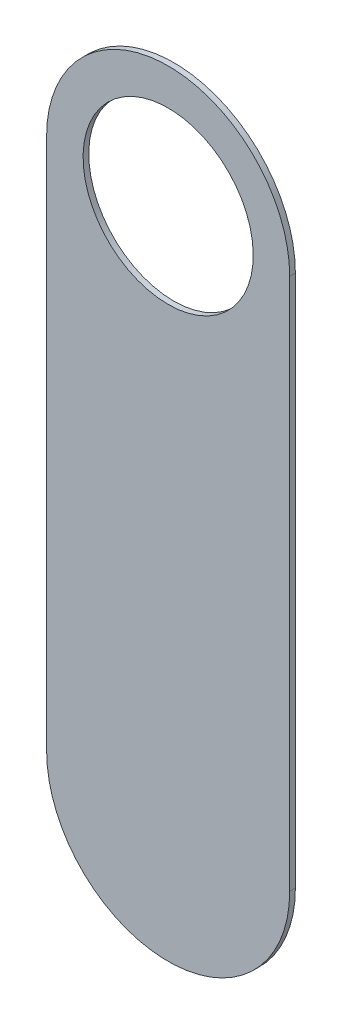
ISO-10303-21;
HEADER;
FILE_DESCRIPTION(('STEP AP214'),'2;1');
FILE_NAME('part.step','',(''),(''),'','','');
FILE_SCHEMA(('AUTOMOTIVE_DESIGN { 1 0 10303 214 1 1 1 1 }'));
ENDSEC;
DATA;
#1=APPLICATION_CONTEXT('core data for automotive mechanical design processes');
#2=APPLICATION_PROTOCOL_DEFINITION('international standard','automotive_design',2000,#1);
#3=PRODUCT_CONTEXT('',#1,'mechanical');
#4=PRODUCT('Part','Part','',(#3));
#5=PRODUCT_RELATED_PRODUCT_CATEGORY('part','',(#4));
#6=PRODUCT_DEFINITION_FORMATION('','',#4);
#7=PRODUCT_DEFINITION_CONTEXT('part definition',#1,'design');
#8=PRODUCT_DEFINITION('design','',#6,#7);
#9=PRODUCT_DEFINITION_SHAPE('','',#8);
#10=(LENGTH_UNIT() NAMED_UNIT(*) SI_UNIT(.MILLI.,.METRE.));
#11=(NAMED_UNIT(*) PLANE_ANGLE_UNIT() SI_UNIT($,.RADIAN.));
#12=(NAMED_UNIT(*) SI_UNIT($,.STERADIAN.) SOLID_ANGLE_UNIT());
#13=UNCERTAINTY_MEASURE_WITH_UNIT(LENGTH_MEASURE(1.E-05),#10,'distance_accuracy_value','');
#14=(GEOMETRIC_REPRESENTATION_CONTEXT(3) GLOBAL_UNCERTAINTY_ASSIGNED_CONTEXT((#13)) GLOBAL_UNIT_ASSIGNED_CONTEXT((#10,
#11,#12)) REPRESENTATION_CONTEXT('',''));
#15=CARTESIAN_POINT('',(0.,0.,0.));
#16=DIRECTION('',(0.,0.,1.));
#17=DIRECTION('',(1.,0.,0.));
#18=AXIS2_PLACEMENT_3D('',#15,#16,#17);
#19=CARTESIAN_POINT('',(154.002,-113.984,-0.045));
#20=DIRECTION('',(0.,0.,-1.));
#21=DIRECTION('',(0.,-1.,0.));
#22=AXIS2_PLACEMENT_3D('',#19,#20,#21);
#23=CYLINDRICAL_SURFACE('',#22,0.525);
#24=CARTESIAN_POINT('',(154.002,-113.984,-0.035));
#25=DIRECTION('',(0.,0.,-1.));
#26=DIRECTION('',(0.,-1.,0.));
#27=AXIS2_PLACEMENT_3D('',#24,#25,#26);
#28=CIRCLE('',#27,0.525);
#29=CARTESIAN_POINT('',(154.002,-114.509,-0.035));
#30=VERTEX_POINT('',#29);
#31=EDGE_CURVE('E116',#30,#30,#28,.T.);
#32=ORIENTED_EDGE('',*,*,#31,.T.);
#33=DIRECTION('',(0.,0.,1.));
#34=VECTOR('',#33,1.);
#35=CARTESIAN_POINT('',(154.002,-114.509,-0.045));
#36=LINE('',#35,#34);
#37=CARTESIAN_POINT('',(154.002,-114.509,0.));
#38=VERTEX_POINT('',#37);
#39=EDGE_CURVE('E11',#30,#38,#36,.T.);
#40=ORIENTED_EDGE('',*,*,#39,.T.);
#41=CARTESIAN_POINT('',(154.002,-113.984,0.));
#42=DIRECTION('',(0.,0.,-1.));
#43=DIRECTION('',(0.,-1.,0.));
#44=AXIS2_PLACEMENT_3D('',#41,#42,#43);
#45=CIRCLE('',#44,0.525);
#46=EDGE_CURVE('E26',#38,#38,#45,.T.);
#47=ORIENTED_EDGE('',*,*,#46,.F.);
#48=ORIENTED_EDGE('',*,*,#39,.F.);
#49=EDGE_LOOP('',(#32,#40,#47,#48));
#50=FACE_BOUND('',#49,.T.);
#51=ADVANCED_FACE('F17',(#50),#23,.F.);
#52=CARTESIAN_POINT('',(154.752,-117.27,-0.035));
#53=DIRECTION('',(-1.,0.,0.));
#54=DIRECTION('',(0.,0.,1.));
#55=AXIS2_PLACEMENT_3D('',#52,#53,#54);
#56=PLANE('',#55);
#57=DIRECTION('',(0.,1.,0.));
#58=VECTOR('',#57,1.);
#59=CARTESIAN_POINT('',(154.752,-117.27,-0.035));
#60=LINE('',#59,#58);
#61=CARTESIAN_POINT('',(154.752,-117.27,-0.035));
#62=VERTEX_POINT('',#61);
#63=CARTESIAN_POINT('',(154.752,-113.984,-0.035));
#64=VERTEX_POINT('',#63);
#65=EDGE_CURVE('E20',#62,#64,#60,.T.);
#66=ORIENTED_EDGE('',*,*,#65,.T.);
#67=DIRECTION('',(0.,0.,1.));
#68=VECTOR('',#67,1.);
#69=CARTESIAN_POINT('',(154.752,-113.984,-0.035));
#70=LINE('',#69,#68);
#71=CARTESIAN_POINT('',(154.752,-113.984,0.));
#72=VERTEX_POINT('',#71);
#73=EDGE_CURVE('E85',#64,#72,#70,.T.);
#74=ORIENTED_EDGE('',*,*,#73,.T.);
#75=DIRECTION('',(0.,1.,0.));
#76=VECTOR('',#75,1.);
#77=CARTESIAN_POINT('',(154.752,-117.27,0.));
#78=LINE('',#77,#76);
#79=CARTESIAN_POINT('',(154.752,-117.27,0.));
#80=VERTEX_POINT('',#79);
#81=EDGE_CURVE('E113',#80,#72,#78,.T.);
#82=ORIENTED_EDGE('',*,*,#81,.F.);
#83=DIRECTION('',(0.,0.,1.));
#84=VECTOR('',#83,1.);
#85=CARTESIAN_POINT('',(154.752,-117.27,-0.035));
#86=LINE('',#85,#84);
#87=EDGE_CURVE('E125',#62,#80,#86,.T.);
#88=ORIENTED_EDGE('',*,*,#87,.F.);
#89=EDGE_LOOP('',(#66,#74,#82,#88));
#90=FACE_BOUND('',#89,.T.);
#91=ADVANCED_FACE('F143',(#90),#56,.F.);
#92=CARTESIAN_POINT('',(153.252,-113.984,0.));
#93=DIRECTION('',(0.,0.,1.));
#94=DIRECTION('',(1.,0.,0.));
#95=AXIS2_PLACEMENT_3D('',#92,#93,#94);
#96=PLANE('',#95);
#97=ORIENTED_EDGE('',*,*,#46,.T.);
#98=EDGE_LOOP('',(#97));
#99=FACE_BOUND('',#98,.T.);
#100=DIRECTION('',(0.,-1.,0.));
#101=VECTOR('',#100,1.);
#102=CARTESIAN_POINT('',(153.252,-113.984,0.));
#103=LINE('',#102,#101);
#104=CARTESIAN_POINT('',(153.252,-113.984,0.));
#105=VERTEX_POINT('',#104);
#106=CARTESIAN_POINT('',(153.252,-117.27,0.));
#107=VERTEX_POINT('',#106);
#108=EDGE_CURVE('E97',#105,#107,#103,.T.);
#109=ORIENTED_EDGE('',*,*,#108,.T.);
#110=CARTESIAN_POINT('',(154.002,-117.27,0.));
#111=DIRECTION('',(0.,0.,1.));
#112=DIRECTION('',(-1.,0.,0.));
#113=AXIS2_PLACEMENT_3D('',#110,#111,#112);
#114=CIRCLE('',#113,0.75);
#115=EDGE_CURVE('E130',#107,#80,#114,.T.);
#116=ORIENTED_EDGE('',*,*,#115,.T.);
#117=ORIENTED_EDGE('',*,*,#81,.T.);
#118=CARTESIAN_POINT('',(154.002,-113.984,0.));
#119=DIRECTION('',(0.,0.,1.));
#120=DIRECTION('',(1.,0.,0.));
#121=AXIS2_PLACEMENT_3D('',#118,#119,#120);
#122=CIRCLE('',#121,0.75);
#123=EDGE_CURVE('E89',#72,#105,#122,.T.);
#124=ORIENTED_EDGE('',*,*,#123,.T.);
#125=EDGE_LOOP('',(#109,#116,#117,#124));
#126=FACE_BOUND('',#125,.T.);
#127=ADVANCED_FACE('F146',(#99,#126),#96,.T.);
#128=CARTESIAN_POINT('',(153.252,-113.984,-0.035));
#129=DIRECTION('',(0.,0.,1.));
#130=DIRECTION('',(1.,0.,0.));
#131=AXIS2_PLACEMENT_3D('',#128,#129,#130);
#132=PLANE('',#131);
#133=ORIENTED_EDGE('',*,*,#31,.F.);
#134=EDGE_LOOP('',(#133));
#135=FACE_BOUND('',#134,.T.);
#136=CARTESIAN_POINT('',(154.002,-113.984,-0.035));
#137=DIRECTION('',(0.,0.,1.));
#138=DIRECTION('',(1.,0.,0.));
#139=AXIS2_PLACEMENT_3D('',#136,#137,#138);
#140=CIRCLE('',#139,0.75);
#141=CARTESIAN_POINT('',(153.252,-113.984,-0.035));
#142=VERTEX_POINT('',#141);
#143=EDGE_CURVE('E78',#64,#142,#140,.T.);
#144=ORIENTED_EDGE('',*,*,#143,.F.);
#145=ORIENTED_EDGE('',*,*,#65,.F.);
#146=CARTESIAN_POINT('',(154.002,-117.27,-0.035));
#147=DIRECTION('',(0.,0.,1.));
#148=DIRECTION('',(-1.,0.,0.));
#149=AXIS2_PLACEMENT_3D('',#146,#147,#148);
#150=CIRCLE('',#149,0.75);
#151=CARTESIAN_POINT('',(153.252,-117.27,-0.035));
#152=VERTEX_POINT('',#151);
#153=EDGE_CURVE('E102',#152,#62,#150,.T.);
#154=ORIENTED_EDGE('',*,*,#153,.F.);
#155=DIRECTION('',(0.,-1.,0.));
#156=VECTOR('',#155,1.);
#157=CARTESIAN_POINT('',(153.252,-113.984,-0.035));
#158=LINE('',#157,#156);
#159=EDGE_CURVE('E95',#142,#152,#158,.T.);
#160=ORIENTED_EDGE('',*,*,#159,.F.);
#161=EDGE_LOOP('',(#144,#145,#154,#160));
#162=FACE_BOUND('',#161,.T.);
#163=ADVANCED_FACE('F100',(#135,#162),#132,.F.);
#164=CARTESIAN_POINT('',(154.002,-117.27,-0.035));
#165=DIRECTION('',(0.,0.,-1.));
#166=DIRECTION('',(-1.,0.,0.));
#167=AXIS2_PLACEMENT_3D('',#164,#165,#166);
#168=CYLINDRICAL_SURFACE('',#167,0.75);
#169=ORIENTED_EDGE('',*,*,#153,.T.);
#170=ORIENTED_EDGE('',*,*,#87,.T.);
#171=ORIENTED_EDGE('',*,*,#115,.F.);
#172=DIRECTION('',(0.,0.,1.));
#173=VECTOR('',#172,1.);
#174=CARTESIAN_POINT('',(153.252,-117.27,-0.035));
#175=LINE('',#174,#173);
#176=EDGE_CURVE('E105',#152,#107,#175,.T.);
#177=ORIENTED_EDGE('',*,*,#176,.F.);
#178=EDGE_LOOP('',(#169,#170,#171,#177));
#179=FACE_BOUND('',#178,.T.);
#180=ADVANCED_FACE('F145',(#179),#168,.T.);
#181=CARTESIAN_POINT('',(154.002,-113.984,-0.035));
#182=DIRECTION('',(0.,0.,-1.));
#183=DIRECTION('',(1.,0.,0.));
#184=AXIS2_PLACEMENT_3D('',#181,#182,#183);
#185=CYLINDRICAL_SURFACE('',#184,0.75);
#186=ORIENTED_EDGE('',*,*,#143,.T.);
#187=DIRECTION('',(0.,0.,1.));
#188=VECTOR('',#187,1.);
#189=CARTESIAN_POINT('',(153.252,-113.984,-0.035));
#190=LINE('',#189,#188);
#191=EDGE_CURVE('E82',#142,#105,#190,.T.);
#192=ORIENTED_EDGE('',*,*,#191,.T.);
#193=ORIENTED_EDGE('',*,*,#123,.F.);
#194=ORIENTED_EDGE('',*,*,#73,.F.);
#195=EDGE_LOOP('',(#186,#192,#193,#194));
#196=FACE_BOUND('',#195,.T.);
#197=ADVANCED_FACE('F80',(#196),#185,.T.);
#198=CARTESIAN_POINT('',(153.252,-113.984,-0.035));
#199=DIRECTION('',(1.,0.,0.));
#200=DIRECTION('',(0.,1.,0.));
#201=AXIS2_PLACEMENT_3D('',#198,#199,#200);
#202=PLANE('',#201);
#203=ORIENTED_EDGE('',*,*,#159,.T.);
#204=ORIENTED_EDGE('',*,*,#176,.T.);
#205=ORIENTED_EDGE('',*,*,#108,.F.);
#206=ORIENTED_EDGE('',*,*,#191,.F.);
#207=EDGE_LOOP('',(#203,#204,#205,#206));
#208=FACE_BOUND('',#207,.T.);
#209=ADVANCED_FACE('F93',(#208),#202,.F.);
#210=CLOSED_SHELL('',(#51,#91,#127,#163,#180,#197,#209));
#211=MANIFOLD_SOLID_BREP('B1',#210);
#212=ADVANCED_BREP_SHAPE_REPRESENTATION('',(#18,#211),#14);
#213=SHAPE_DEFINITION_REPRESENTATION(#9,#212);
ENDSEC;
END-ISO-10303-21;
